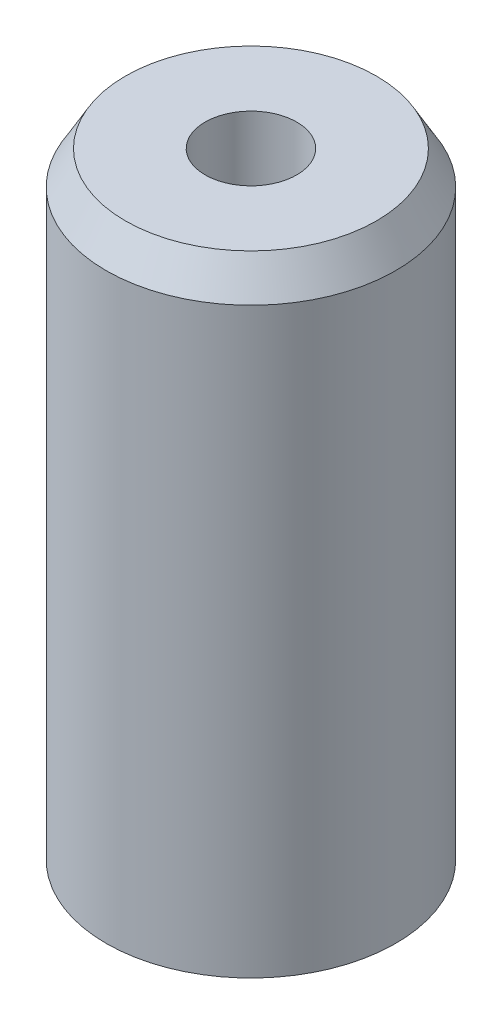
ISO-10303-21;
HEADER;
FILE_DESCRIPTION(('STEP AP214'),'2;1');
FILE_NAME('part.step','',(''),(''),'','','');
FILE_SCHEMA(('AUTOMOTIVE_DESIGN { 1 0 10303 214 1 1 1 1 }'));
ENDSEC;
DATA;
#1=APPLICATION_CONTEXT('core data for automotive mechanical design processes');
#2=APPLICATION_PROTOCOL_DEFINITION('international standard','automotive_design',2000,#1);
#3=PRODUCT_CONTEXT('',#1,'mechanical');
#4=PRODUCT('Part','Part','',(#3));
#5=PRODUCT_RELATED_PRODUCT_CATEGORY('part','',(#4));
#6=PRODUCT_DEFINITION_FORMATION('','',#4);
#7=PRODUCT_DEFINITION_CONTEXT('part definition',#1,'design');
#8=PRODUCT_DEFINITION('design','',#6,#7);
#9=PRODUCT_DEFINITION_SHAPE('','',#8);
#10=(LENGTH_UNIT() NAMED_UNIT(*) SI_UNIT(.MILLI.,.METRE.));
#11=(NAMED_UNIT(*) PLANE_ANGLE_UNIT() SI_UNIT($,.RADIAN.));
#12=(NAMED_UNIT(*) SI_UNIT($,.STERADIAN.) SOLID_ANGLE_UNIT());
#13=UNCERTAINTY_MEASURE_WITH_UNIT(LENGTH_MEASURE(1.E-05),#10,'distance_accuracy_value','');
#14=(GEOMETRIC_REPRESENTATION_CONTEXT(3) GLOBAL_UNCERTAINTY_ASSIGNED_CONTEXT((#13)) GLOBAL_UNIT_ASSIGNED_CONTEXT((#10,
#11,#12)) REPRESENTATION_CONTEXT('',''));
#15=CARTESIAN_POINT('',(0.,0.,0.));
#16=DIRECTION('',(0.,0.,1.));
#17=DIRECTION('',(1.,0.,0.));
#18=AXIS2_PLACEMENT_3D('',#15,#16,#17);
#19=CARTESIAN_POINT('',(0.,87.7577772834674,0.));
#20=DIRECTION('',(0.,-1.,0.));
#21=DIRECTION('',(0.,0.,-1.));
#22=AXIS2_PLACEMENT_3D('',#19,#20,#21);
#23=CYLINDRICAL_SURFACE('',#22,20.);
#24=CARTESIAN_POINT('',(0.,83.1425485286204,0.));
#25=DIRECTION('',(0.,1.,0.));
#26=DIRECTION('',(0.,0.,1.));
#27=AXIS2_PLACEMENT_3D('',#24,#25,#26);
#28=CIRCLE('',#27,20.);
#29=CARTESIAN_POINT('',(0.,83.1425485286204,20.));
#30=VERTEX_POINT('',#29);
#31=EDGE_CURVE('E50',#30,#30,#28,.F.);
#32=ORIENTED_EDGE('',*,*,#31,.T.);
#33=EDGE_LOOP('',(#32));
#34=FACE_BOUND('',#33,.T.);
#35=CARTESIAN_POINT('',(0.,2.6646035639826,0.));
#36=DIRECTION('',(0.,1.,0.));
#37=DIRECTION('',(0.,0.,1.));
#38=AXIS2_PLACEMENT_3D('',#35,#36,#37);
#39=CIRCLE('',#38,20.);
#40=CARTESIAN_POINT('',(0.,2.6646035639826,20.));
#41=VERTEX_POINT('',#40);
#42=EDGE_CURVE('E51',#41,#41,#39,.T.);
#43=ORIENTED_EDGE('',*,*,#42,.T.);
#44=EDGE_LOOP('',(#43));
#45=FACE_BOUND('',#44,.T.);
#46=ADVANCED_FACE('F39',(#34,#45),#23,.T.);
#47=CARTESIAN_POINT('',(0.,87.7577772834674,0.));
#48=DIRECTION('',(0.,1.,0.));
#49=DIRECTION('',(0.,0.,1.));
#50=AXIS2_PLACEMENT_3D('',#47,#48,#49);
#51=PLANE('',#50);
#52=CARTESIAN_POINT('',(0.,87.7577772834674,0.));
#53=DIRECTION('',(0.,1.,0.));
#54=DIRECTION('',(0.,0.,1.));
#55=AXIS2_PLACEMENT_3D('',#52,#53,#54);
#56=CIRCLE('',#55,17.3353964360174);
#57=CARTESIAN_POINT('',(0.,87.7577772834674,17.3353964360174));
#58=VERTEX_POINT('',#57);
#59=EDGE_CURVE('E54',#58,#58,#56,.T.);
#60=ORIENTED_EDGE('',*,*,#59,.T.);
#61=EDGE_LOOP('',(#60));
#62=FACE_BOUND('',#61,.T.);
#63=CARTESIAN_POINT('',(0.,87.7577772834674,0.));
#64=DIRECTION('',(0.,1.,0.));
#65=DIRECTION('',(0.,0.,1.));
#66=AXIS2_PLACEMENT_3D('',#63,#64,#65);
#67=CIRCLE('',#66,6.32899762307678);
#68=CARTESIAN_POINT('',(0.,87.7577772834674,6.32899762307678));
#69=VERTEX_POINT('',#68);
#70=EDGE_CURVE('E58',#69,#69,#67,.T.);
#71=ORIENTED_EDGE('',*,*,#70,.F.);
#72=EDGE_LOOP('',(#71));
#73=FACE_BOUND('',#72,.T.);
#74=ADVANCED_FACE('F69',(#62,#73),#51,.T.);
#75=CARTESIAN_POINT('',(0.,0.,0.));
#76=DIRECTION('',(0.,1.,0.));
#77=DIRECTION('',(0.,0.,1.));
#78=AXIS2_PLACEMENT_3D('',#75,#76,#77);
#79=PLANE('',#78);
#80=CARTESIAN_POINT('',(0.,0.,0.));
#81=DIRECTION('',(0.,1.,0.));
#82=DIRECTION('',(0.,0.,1.));
#83=AXIS2_PLACEMENT_3D('',#80,#81,#82);
#84=CIRCLE('',#83,15.384771245153);
#85=CARTESIAN_POINT('',(0.,0.,15.384771245153));
#86=VERTEX_POINT('',#85);
#87=EDGE_CURVE('E10',#86,#86,#84,.F.);
#88=ORIENTED_EDGE('',*,*,#87,.T.);
#89=EDGE_LOOP('',(#88));
#90=FACE_BOUND('',#89,.T.);
#91=CARTESIAN_POINT('',(0.,0.,0.));
#92=DIRECTION('',(0.,1.,0.));
#93=DIRECTION('',(0.,0.,1.));
#94=AXIS2_PLACEMENT_3D('',#91,#92,#93);
#95=CIRCLE('',#94,6.32899762307678);
#96=CARTESIAN_POINT('',(0.,0.,6.32899762307678));
#97=VERTEX_POINT('',#96);
#98=EDGE_CURVE('E63',#97,#97,#95,.T.);
#99=ORIENTED_EDGE('',*,*,#98,.T.);
#100=EDGE_LOOP('',(#99));
#101=FACE_BOUND('',#100,.T.);
#102=ADVANCED_FACE('F75',(#90,#101),#79,.F.);
#103=CARTESIAN_POINT('',(0.,87.7577772834674,0.));
#104=DIRECTION('',(0.,-1.,0.));
#105=DIRECTION('',(0.,0.,-1.));
#106=AXIS2_PLACEMENT_3D('',#103,#104,#105);
#107=CYLINDRICAL_SURFACE('',#106,6.32899762307678);
#108=ORIENTED_EDGE('',*,*,#70,.T.);
#109=EDGE_LOOP('',(#108));
#110=FACE_BOUND('',#109,.T.);
#111=ORIENTED_EDGE('',*,*,#98,.F.);
#112=EDGE_LOOP('',(#111));
#113=FACE_BOUND('',#112,.T.);
#114=ADVANCED_FACE('F70',(#110,#113),#107,.F.);
#115=CARTESIAN_POINT('',(0.,87.7577772834674,0.));
#116=DIRECTION('',(0.,-1.,0.));
#117=DIRECTION('',(0.,0.,-1.));
#118=AXIS2_PLACEMENT_3D('',#115,#116,#117);
#119=CONICAL_SURFACE('',#118,17.3353964360174,0.523598775598297);
#120=ORIENTED_EDGE('',*,*,#31,.F.);
#121=EDGE_LOOP('',(#120));
#122=FACE_BOUND('',#121,.T.);
#123=ORIENTED_EDGE('',*,*,#59,.F.);
#124=EDGE_LOOP('',(#123));
#125=FACE_BOUND('',#124,.T.);
#126=ADVANCED_FACE('F81',(#122,#125),#119,.T.);
#127=CARTESIAN_POINT('',(0.,2.6646035639826,0.));
#128=DIRECTION('',(0.,1.,0.));
#129=DIRECTION('',(0.,0.,1.));
#130=AXIS2_PLACEMENT_3D('',#127,#128,#129);
#131=CONICAL_SURFACE('',#130,20.,1.0471975511966);
#132=CARTESIAN_POINT('',(0.,0.,15.384771245153));
#133=CARTESIAN_POINT('',(0.,0.0277562871248187,15.4328465446827));
#134=CARTESIAN_POINT('',(0.,0.0555125742496373,15.4809218442123));
#135=CARTESIAN_POINT('',(0.,0.111025148499275,15.5770724432716));
#136=CARTESIAN_POINT('',(0.,0.138781435624093,15.6251477428013));
#137=CARTESIAN_POINT('',(0.,0.194294009873731,15.7212983418606));
#138=CARTESIAN_POINT('',(0.,0.222050296998549,15.7693736413902));
#139=CARTESIAN_POINT('',(0.,0.277562871248187,15.8655242404496));
#140=CARTESIAN_POINT('',(0.,0.305319158373006,15.9135995399792));
#141=CARTESIAN_POINT('',(0.,0.360831732622643,16.0097501390385));
#142=CARTESIAN_POINT('',(0.,0.388588019747462,16.0578254385682));
#143=CARTESIAN_POINT('',(0.,0.444100593997099,16.1539760376275));
#144=CARTESIAN_POINT('',(0.,0.471856881121918,16.2020513371572));
#145=CARTESIAN_POINT('',(0.,0.527369455371555,16.2982019362165));
#146=CARTESIAN_POINT('',(0.,0.555125742496374,16.3462772357461));
#147=CARTESIAN_POINT('',(0.,0.610638316746012,16.4424278348054));
#148=CARTESIAN_POINT('',(0.,0.63839460387083,16.4905031343351));
#149=CARTESIAN_POINT('',(0.,0.693907178120468,16.5866537333944));
#150=CARTESIAN_POINT('',(0.,0.721663465245286,16.6347290329241));
#151=CARTESIAN_POINT('',(0.,0.777176039494924,16.7308796319834));
#152=CARTESIAN_POINT('',(0.,0.804932326619743,16.778954931513));
#153=CARTESIAN_POINT('',(0.,0.86044490086938,16.8751055305723));
#154=CARTESIAN_POINT('',(0.,0.888201187994199,16.923180830102));
#155=CARTESIAN_POINT('',(0.,0.943713762243836,17.0193314291613));
#156=CARTESIAN_POINT('',(0.,0.971470049368655,17.067406728691));
#157=CARTESIAN_POINT('',(0.,1.02698262361829,17.1635573277503));
#158=CARTESIAN_POINT('',(0.,1.05473891074311,17.2116326272799));
#159=CARTESIAN_POINT('',(0.,1.11025148499275,17.3077832263393));
#160=CARTESIAN_POINT('',(0.,1.13800777211757,17.3558585258689));
#161=CARTESIAN_POINT('',(0.,1.19352034636721,17.4520091249282));
#162=CARTESIAN_POINT('',(0.,1.22127663349202,17.5000844244579));
#163=CARTESIAN_POINT('',(0.,1.27678920774166,17.5962350235172));
#164=CARTESIAN_POINT('',(0.,1.30454549486648,17.6443103230468));
#165=CARTESIAN_POINT('',(0.,1.36005806911612,17.7404609221062));
#166=CARTESIAN_POINT('',(0.,1.38781435624094,17.7885362216358));
#167=CARTESIAN_POINT('',(0.,1.44332693049057,17.8846868206951));
#168=CARTESIAN_POINT('',(0.,1.47108321761539,17.9327621202248));
#169=CARTESIAN_POINT('',(0.,1.52659579186503,18.0289127192841));
#170=CARTESIAN_POINT('',(0.,1.55435207898985,18.0769880188137));
#171=CARTESIAN_POINT('',(0.,1.60986465323949,18.1731386178731));
#172=CARTESIAN_POINT('',(0.,1.6376209403643,18.2212139174027));
#173=CARTESIAN_POINT('',(0.,1.69313351461394,18.317364516462));
#174=CARTESIAN_POINT('',(0.,1.72088980173876,18.3654398159917));
#175=CARTESIAN_POINT('',(0.,1.7764023759884,18.461590415051));
#176=CARTESIAN_POINT('',(0.,1.80415866311322,18.5096657145807));
#177=CARTESIAN_POINT('',(0.,1.85967123736285,18.60581631364));
#178=CARTESIAN_POINT('',(0.,1.88742752448767,18.6538916131696));
#179=CARTESIAN_POINT('',(0.,1.94294009873731,18.7500422122289));
#180=CARTESIAN_POINT('',(0.,1.97069638586213,18.7981175117586));
#181=CARTESIAN_POINT('',(0.,2.02620896011177,18.8942681108179));
#182=CARTESIAN_POINT('',(0.,2.05396524723659,18.9423434103476));
#183=CARTESIAN_POINT('',(0.,2.10947782148622,19.0384940094069));
#184=CARTESIAN_POINT('',(0.,2.13723410861104,19.0865693089365));
#185=CARTESIAN_POINT('',(0.,2.19274668286068,19.1827199079958));
#186=CARTESIAN_POINT('',(0.,2.2205029699855,19.2307952075255));
#187=CARTESIAN_POINT('',(0.,2.27601554423514,19.3269458065848));
#188=CARTESIAN_POINT('',(0.,2.30377183135995,19.3750211061145));
#189=CARTESIAN_POINT('',(0.,2.35928440560959,19.4711717051738));
#190=CARTESIAN_POINT('',(0.,2.38704069273441,19.5192470047034));
#191=CARTESIAN_POINT('',(0.,2.44255326698405,19.6153976037628));
#192=CARTESIAN_POINT('',(0.,2.47030955410887,19.6634729032924));
#193=CARTESIAN_POINT('',(0.,2.5258221283585,19.7596235023517));
#194=CARTESIAN_POINT('',(0.,2.55357841548332,19.8076988018814));
#195=CARTESIAN_POINT('',(0.,2.60909098973296,19.9038494009407));
#196=CARTESIAN_POINT('',(0.,2.63684727685778,19.9519247004703));
#197=CARTESIAN_POINT('',(0.,2.6646035639826,20.));
#198=B_SPLINE_CURVE_WITH_KNOTS('',3,(#132,#133,#134,#135,#136,#137,#138,#139,#140,#141,#142,
#143,#144,#145,#146,#147,#148,#149,#150,#151,#152,#153,#154,#155,#156,#157,#158,#159,#160,#161,
#162,#163,#164,#165,#166,#167,#168,#169,#170,#171,#172,#173,#174,#175,#176,#177,#178,#179,#180,
#181,#182,#183,#184,#185,#186,#187,#188,#189,#190,#191,#192,#193,#194,#195,#196,#197),
.UNSPECIFIED.,.F.,.F.,(4,2,2,2,2,2,2,2,2,2,2,2,2,2,2,2,2,2,2,2,2,2,2,2,2,2,2,2,2,2,2,2,4),(0.,
0.166537722748913,0.333075445497827,0.49961316824674,0.666150890995653,0.832688613744566,
0.99922633649348,1.16576405924239,1.33230178199131,1.49883950474022,1.66537722748913,
1.83191495023805,1.99845267298696,2.16499039573587,2.33152811848479,2.4980658412337,
2.66460356398261,2.83114128673152,2.99767900948044,3.16421673222935,3.33075445497827,
3.49729217772718,3.66382990047609,3.830367623225,3.99690534597392,4.16344306872283,
4.32998079147174,4.49651851422066,4.66305623696957,4.82959395971849,4.9961316824674,
5.16266940521631,5.32920712796523),.UNSPECIFIED.);
#199=EDGE_CURVE('BSEAM45',#86,#41,#198,.T.);
#200=ORIENTED_EDGE('',*,*,#87,.F.);
#201=ORIENTED_EDGE('',*,*,#42,.F.);
#202=ORIENTED_EDGE('',*,*,#199,.T.);
#203=ORIENTED_EDGE('',*,*,#199,.F.);
#204=EDGE_LOOP('',(#200,#202,#201,#203));
#205=FACE_BOUND('',#204,.T.);
#206=ADVANCED_FACE('F45',(#205),#131,.T.);
#207=CLOSED_SHELL('',(#46,#74,#102,#114,#126,#206));
#208=MANIFOLD_SOLID_BREP('B2',#207);
#209=ADVANCED_BREP_SHAPE_REPRESENTATION('',(#18,#208),#14);
#210=SHAPE_DEFINITION_REPRESENTATION(#9,#209);
ENDSEC;
END-ISO-10303-21;
